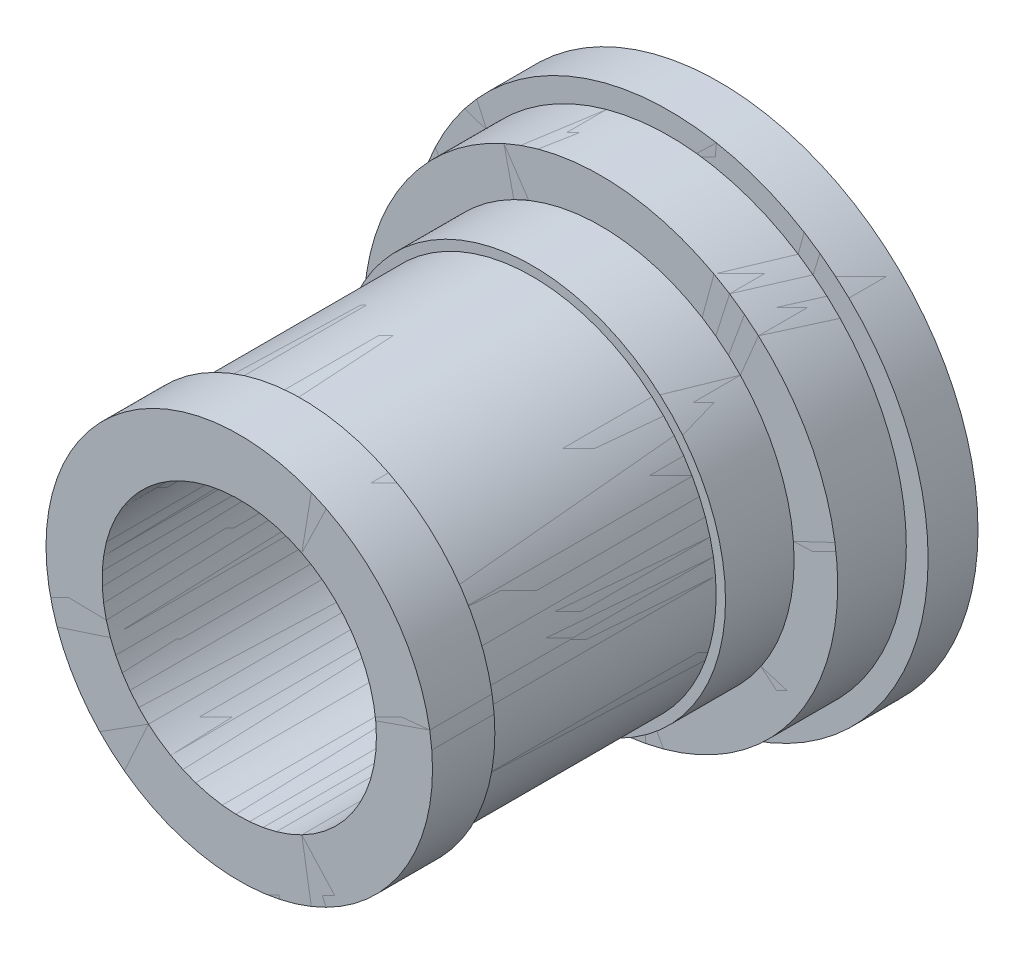
ISO-10303-21;
HEADER;
FILE_DESCRIPTION(('STEP AP214'),'2;1');
FILE_NAME('part.step','',(''),(''),'','','');
FILE_SCHEMA(('AUTOMOTIVE_DESIGN { 1 0 10303 214 1 1 1 1 }'));
ENDSEC;
DATA;
#1=APPLICATION_CONTEXT('core data for automotive mechanical design processes');
#2=APPLICATION_PROTOCOL_DEFINITION('international standard','automotive_design',2000,#1);
#3=PRODUCT_CONTEXT('',#1,'mechanical');
#4=PRODUCT('Part','Part','',(#3));
#5=PRODUCT_RELATED_PRODUCT_CATEGORY('part','',(#4));
#6=PRODUCT_DEFINITION_FORMATION('','',#4);
#7=PRODUCT_DEFINITION_CONTEXT('part definition',#1,'design');
#8=PRODUCT_DEFINITION('design','',#6,#7);
#9=PRODUCT_DEFINITION_SHAPE('','',#8);
#10=(LENGTH_UNIT() NAMED_UNIT(*) SI_UNIT(.MILLI.,.METRE.));
#11=(NAMED_UNIT(*) PLANE_ANGLE_UNIT() SI_UNIT($,.RADIAN.));
#12=(NAMED_UNIT(*) SI_UNIT($,.STERADIAN.) SOLID_ANGLE_UNIT());
#13=UNCERTAINTY_MEASURE_WITH_UNIT(LENGTH_MEASURE(1.E-05),#10,'distance_accuracy_value','');
#14=(GEOMETRIC_REPRESENTATION_CONTEXT(3) GLOBAL_UNCERTAINTY_ASSIGNED_CONTEXT((#13)) GLOBAL_UNIT_ASSIGNED_CONTEXT((#10,
#11,#12)) REPRESENTATION_CONTEXT('',''));
#15=CARTESIAN_POINT('',(0.,0.,0.));
#16=DIRECTION('',(0.,0.,1.));
#17=DIRECTION('',(1.,0.,0.));
#18=AXIS2_PLACEMENT_3D('',#15,#16,#17);
#19=CARTESIAN_POINT('',(-22.,0.,-77.));
#20=DIRECTION('',(0.,0.,1.));
#21=DIRECTION('',(1.,0.,0.));
#22=AXIS2_PLACEMENT_3D('',#19,#20,#21);
#23=PLANE('',#22);
#24=CARTESIAN_POINT('',(0.,0.,-77.));
#25=DIRECTION('',(0.,0.,1.));
#26=DIRECTION('',(1.,0.,0.));
#27=AXIS2_PLACEMENT_3D('',#24,#25,#26);
#28=CIRCLE('',#27,41.5);
#29=CARTESIAN_POINT('',(41.5,0.,-77.));
#30=VERTEX_POINT('',#29);
#31=EDGE_CURVE('E78',#30,#30,#28,.T.);
#32=ORIENTED_EDGE('',*,*,#31,.F.);
#33=EDGE_LOOP('',(#32));
#34=FACE_BOUND('',#33,.T.);
#35=CARTESIAN_POINT('',(0.,0.,-77.));
#36=DIRECTION('',(0.,0.,1.));
#37=DIRECTION('',(1.,0.,0.));
#38=AXIS2_PLACEMENT_3D('',#35,#36,#37);
#39=CIRCLE('',#38,22.);
#40=CARTESIAN_POINT('',(22.,0.,-77.));
#41=VERTEX_POINT('',#40);
#42=EDGE_CURVE('E11',#41,#41,#39,.T.);
#43=ORIENTED_EDGE('',*,*,#42,.T.);
#44=EDGE_LOOP('',(#43));
#45=FACE_BOUND('',#44,.T.);
#46=ADVANCED_FACE('F38',(#34,#45),#23,.F.);
#47=CARTESIAN_POINT('',(0.,0.,0.));
#48=DIRECTION('',(0.,0.,1.));
#49=DIRECTION('',(1.,0.,0.));
#50=AXIS2_PLACEMENT_3D('',#47,#48,#49);
#51=CYLINDRICAL_SURFACE('',#50,22.);
#52=ORIENTED_EDGE('',*,*,#42,.F.);
#53=EDGE_LOOP('',(#52));
#54=FACE_BOUND('',#53,.T.);
#55=CARTESIAN_POINT('',(0.,0.,0.));
#56=DIRECTION('',(0.,0.,1.));
#57=DIRECTION('',(1.,0.,0.));
#58=AXIS2_PLACEMENT_3D('',#55,#56,#57);
#59=CIRCLE('',#58,22.);
#60=CARTESIAN_POINT('',(22.,0.,0.));
#61=VERTEX_POINT('',#60);
#62=EDGE_CURVE('E44',#61,#61,#59,.T.);
#63=ORIENTED_EDGE('',*,*,#62,.T.);
#64=EDGE_LOOP('',(#63));
#65=FACE_BOUND('',#64,.T.);
#66=ADVANCED_FACE('F85',(#54,#65),#51,.F.);
#67=CARTESIAN_POINT('',(-22.,0.,0.));
#68=DIRECTION('',(0.,0.,-1.));
#69=DIRECTION('',(-1.,0.,0.));
#70=AXIS2_PLACEMENT_3D('',#67,#68,#69);
#71=PLANE('',#70);
#72=ORIENTED_EDGE('',*,*,#62,.F.);
#73=EDGE_LOOP('',(#72));
#74=FACE_BOUND('',#73,.T.);
#75=CARTESIAN_POINT('',(0.,0.,0.));
#76=DIRECTION('',(0.,0.,1.));
#77=DIRECTION('',(1.,0.,0.));
#78=AXIS2_PLACEMENT_3D('',#75,#76,#77);
#79=CIRCLE('',#78,31.);
#80=CARTESIAN_POINT('',(31.,0.,0.));
#81=VERTEX_POINT('',#80);
#82=EDGE_CURVE('E48',#81,#81,#79,.T.);
#83=ORIENTED_EDGE('',*,*,#82,.T.);
#84=EDGE_LOOP('',(#83));
#85=FACE_BOUND('',#84,.T.);
#86=ADVANCED_FACE('F89',(#74,#85),#71,.F.);
#87=CARTESIAN_POINT('',(0.,0.,0.));
#88=DIRECTION('',(0.,0.,1.));
#89=DIRECTION('',(1.,0.,0.));
#90=AXIS2_PLACEMENT_3D('',#87,#88,#89);
#91=CYLINDRICAL_SURFACE('',#90,31.);
#92=ORIENTED_EDGE('',*,*,#82,.F.);
#93=EDGE_LOOP('',(#92));
#94=FACE_BOUND('',#93,.T.);
#95=CARTESIAN_POINT('',(0.,0.,-10.));
#96=DIRECTION('',(0.,0.,1.));
#97=DIRECTION('',(1.,0.,0.));
#98=AXIS2_PLACEMENT_3D('',#95,#96,#97);
#99=CIRCLE('',#98,31.);
#100=CARTESIAN_POINT('',(31.,0.,-10.));
#101=VERTEX_POINT('',#100);
#102=EDGE_CURVE('E52',#101,#101,#99,.T.);
#103=ORIENTED_EDGE('',*,*,#102,.T.);
#104=EDGE_LOOP('',(#103));
#105=FACE_BOUND('',#104,.T.);
#106=ADVANCED_FACE('F94',(#94,#105),#91,.T.);
#107=CARTESIAN_POINT('',(-29.5,0.,-10.));
#108=DIRECTION('',(0.,0.,1.));
#109=DIRECTION('',(1.,0.,0.));
#110=AXIS2_PLACEMENT_3D('',#107,#108,#109);
#111=PLANE('',#110);
#112=ORIENTED_EDGE('',*,*,#102,.F.);
#113=EDGE_LOOP('',(#112));
#114=FACE_BOUND('',#113,.T.);
#115=CARTESIAN_POINT('',(0.,0.,-10.));
#116=DIRECTION('',(0.,0.,1.));
#117=DIRECTION('',(1.,0.,0.));
#118=AXIS2_PLACEMENT_3D('',#115,#116,#117);
#119=CIRCLE('',#118,29.5);
#120=CARTESIAN_POINT('',(29.5,0.,-10.));
#121=VERTEX_POINT('',#120);
#122=EDGE_CURVE('E57',#121,#121,#119,.T.);
#123=ORIENTED_EDGE('',*,*,#122,.T.);
#124=EDGE_LOOP('',(#123));
#125=FACE_BOUND('',#124,.T.);
#126=ADVANCED_FACE('F100',(#114,#125),#111,.F.);
#127=CARTESIAN_POINT('',(0.,0.,0.));
#128=DIRECTION('',(0.,0.,1.));
#129=DIRECTION('',(1.,0.,0.));
#130=AXIS2_PLACEMENT_3D('',#127,#128,#129);
#131=CYLINDRICAL_SURFACE('',#130,29.5);
#132=ORIENTED_EDGE('',*,*,#122,.F.);
#133=EDGE_LOOP('',(#132));
#134=FACE_BOUND('',#133,.T.);
#135=CARTESIAN_POINT('',(0.,0.,-47.));
#136=DIRECTION('',(0.,0.,1.));
#137=DIRECTION('',(1.,0.,0.));
#138=AXIS2_PLACEMENT_3D('',#135,#136,#137);
#139=CIRCLE('',#138,29.5);
#140=CARTESIAN_POINT('',(29.5,0.,-47.));
#141=VERTEX_POINT('',#140);
#142=EDGE_CURVE('E60',#141,#141,#139,.T.);
#143=ORIENTED_EDGE('',*,*,#142,.T.);
#144=EDGE_LOOP('',(#143));
#145=FACE_BOUND('',#144,.T.);
#146=ADVANCED_FACE('F104',(#134,#145),#131,.T.);
#147=CARTESIAN_POINT('',(-29.5,0.,-47.));
#148=DIRECTION('',(0.,0.,-1.));
#149=DIRECTION('',(-1.,0.,0.));
#150=AXIS2_PLACEMENT_3D('',#147,#148,#149);
#151=PLANE('',#150);
#152=ORIENTED_EDGE('',*,*,#142,.F.);
#153=EDGE_LOOP('',(#152));
#154=FACE_BOUND('',#153,.T.);
#155=CARTESIAN_POINT('',(0.,0.,-47.));
#156=DIRECTION('',(0.,0.,1.));
#157=DIRECTION('',(1.,0.,0.));
#158=AXIS2_PLACEMENT_3D('',#155,#156,#157);
#159=CIRCLE('',#158,31.);
#160=CARTESIAN_POINT('',(31.,0.,-47.));
#161=VERTEX_POINT('',#160);
#162=EDGE_CURVE('E63',#161,#161,#159,.T.);
#163=ORIENTED_EDGE('',*,*,#162,.T.);
#164=EDGE_LOOP('',(#163));
#165=FACE_BOUND('',#164,.T.);
#166=ADVANCED_FACE('F108',(#154,#165),#151,.F.);
#167=CARTESIAN_POINT('',(0.,0.,0.));
#168=DIRECTION('',(0.,0.,1.));
#169=DIRECTION('',(1.,0.,0.));
#170=AXIS2_PLACEMENT_3D('',#167,#168,#169);
#171=CYLINDRICAL_SURFACE('',#170,31.);
#172=ORIENTED_EDGE('',*,*,#162,.F.);
#173=EDGE_LOOP('',(#172));
#174=FACE_BOUND('',#173,.T.);
#175=CARTESIAN_POINT('',(0.,0.,-58.));
#176=DIRECTION('',(0.,0.,1.));
#177=DIRECTION('',(1.,0.,0.));
#178=AXIS2_PLACEMENT_3D('',#175,#176,#177);
#179=CIRCLE('',#178,31.);
#180=CARTESIAN_POINT('',(31.,0.,-58.));
#181=VERTEX_POINT('',#180);
#182=EDGE_CURVE('E66',#181,#181,#179,.T.);
#183=ORIENTED_EDGE('',*,*,#182,.T.);
#184=EDGE_LOOP('',(#183));
#185=FACE_BOUND('',#184,.T.);
#186=ADVANCED_FACE('F112',(#174,#185),#171,.T.);
#187=CARTESIAN_POINT('',(-31.,0.,-58.));
#188=DIRECTION('',(0.,0.,-1.));
#189=DIRECTION('',(-1.,0.,0.));
#190=AXIS2_PLACEMENT_3D('',#187,#188,#189);
#191=PLANE('',#190);
#192=ORIENTED_EDGE('',*,*,#182,.F.);
#193=EDGE_LOOP('',(#192));
#194=FACE_BOUND('',#193,.T.);
#195=CARTESIAN_POINT('',(0.,0.,-58.));
#196=DIRECTION('',(0.,0.,1.));
#197=DIRECTION('',(1.,0.,0.));
#198=AXIS2_PLACEMENT_3D('',#195,#196,#197);
#199=CIRCLE('',#198,38.);
#200=CARTESIAN_POINT('',(38.,0.,-58.));
#201=VERTEX_POINT('',#200);
#202=EDGE_CURVE('E69',#201,#201,#199,.T.);
#203=ORIENTED_EDGE('',*,*,#202,.T.);
#204=EDGE_LOOP('',(#203));
#205=FACE_BOUND('',#204,.T.);
#206=ADVANCED_FACE('F116',(#194,#205),#191,.F.);
#207=CARTESIAN_POINT('',(0.,0.,0.));
#208=DIRECTION('',(0.,0.,1.));
#209=DIRECTION('',(1.,0.,0.));
#210=AXIS2_PLACEMENT_3D('',#207,#208,#209);
#211=CYLINDRICAL_SURFACE('',#210,38.);
#212=ORIENTED_EDGE('',*,*,#202,.F.);
#213=EDGE_LOOP('',(#212));
#214=FACE_BOUND('',#213,.T.);
#215=CARTESIAN_POINT('',(0.,0.,-69.));
#216=DIRECTION('',(0.,0.,1.));
#217=DIRECTION('',(1.,0.,0.));
#218=AXIS2_PLACEMENT_3D('',#215,#216,#217);
#219=CIRCLE('',#218,38.);
#220=CARTESIAN_POINT('',(38.,0.,-69.));
#221=VERTEX_POINT('',#220);
#222=EDGE_CURVE('E72',#221,#221,#219,.T.);
#223=ORIENTED_EDGE('',*,*,#222,.T.);
#224=EDGE_LOOP('',(#223));
#225=FACE_BOUND('',#224,.T.);
#226=ADVANCED_FACE('F120',(#214,#225),#211,.T.);
#227=CARTESIAN_POINT('',(-38.,0.,-69.));
#228=DIRECTION('',(0.,0.,-1.));
#229=DIRECTION('',(-1.,0.,0.));
#230=AXIS2_PLACEMENT_3D('',#227,#228,#229);
#231=PLANE('',#230);
#232=ORIENTED_EDGE('',*,*,#222,.F.);
#233=EDGE_LOOP('',(#232));
#234=FACE_BOUND('',#233,.T.);
#235=CARTESIAN_POINT('',(0.,0.,-69.));
#236=DIRECTION('',(0.,0.,1.));
#237=DIRECTION('',(1.,0.,0.));
#238=AXIS2_PLACEMENT_3D('',#235,#236,#237);
#239=CIRCLE('',#238,41.5);
#240=CARTESIAN_POINT('',(41.5,0.,-69.));
#241=VERTEX_POINT('',#240);
#242=EDGE_CURVE('E75',#241,#241,#239,.T.);
#243=ORIENTED_EDGE('',*,*,#242,.T.);
#244=EDGE_LOOP('',(#243));
#245=FACE_BOUND('',#244,.T.);
#246=ADVANCED_FACE('F124',(#234,#245),#231,.F.);
#247=CARTESIAN_POINT('',(0.,0.,0.));
#248=DIRECTION('',(0.,0.,1.));
#249=DIRECTION('',(1.,0.,0.));
#250=AXIS2_PLACEMENT_3D('',#247,#248,#249);
#251=CYLINDRICAL_SURFACE('',#250,41.5);
#252=ORIENTED_EDGE('',*,*,#242,.F.);
#253=EDGE_LOOP('',(#252));
#254=FACE_BOUND('',#253,.T.);
#255=ORIENTED_EDGE('',*,*,#31,.T.);
#256=EDGE_LOOP('',(#255));
#257=FACE_BOUND('',#256,.T.);
#258=ADVANCED_FACE('F82',(#254,#257),#251,.T.);
#259=CLOSED_SHELL('',(#46,#66,#86,#106,#126,#146,#166,#186,#206,#226,#246,#258));
#260=MANIFOLD_SOLID_BREP('B2',#259);
#261=CARTESIAN_POINT('',(22.,0.,0.));
#262=DIRECTION('',(0.,0.,1.));
#263=DIRECTION('',(1.,0.,0.));
#264=AXIS2_PLACEMENT_3D('',#261,#262,#263);
#265=PLANE('',#264);
#266=CARTESIAN_POINT('',(0.,0.,0.));
#267=DIRECTION('',(0.,0.,1.));
#268=DIRECTION('',(1.,0.,0.));
#269=AXIS2_PLACEMENT_3D('',#266,#267,#268);
#270=CIRCLE('',#269,31.);
#271=CARTESIAN_POINT('',(31.,0.,0.));
#272=VERTEX_POINT('',#271);
#273=EDGE_CURVE('E37',#272,#272,#270,.T.);
#274=ORIENTED_EDGE('',*,*,#273,.T.);
#275=EDGE_LOOP('',(#274));
#276=FACE_BOUND('',#275,.T.);
#277=CARTESIAN_POINT('',(0.,0.,0.));
#278=DIRECTION('',(0.,0.,1.));
#279=DIRECTION('',(1.,0.,0.));
#280=AXIS2_PLACEMENT_3D('',#277,#278,#279);
#281=CIRCLE('',#280,22.);
#282=CARTESIAN_POINT('',(22.,0.,0.));
#283=VERTEX_POINT('',#282);
#284=EDGE_CURVE('E259',#283,#283,#281,.T.);
#285=ORIENTED_EDGE('',*,*,#284,.F.);
#286=EDGE_LOOP('',(#285));
#287=FACE_BOUND('',#286,.T.);
#288=ADVANCED_FACE('F219',(#276,#287),#265,.T.);
#289=CARTESIAN_POINT('',(0.,0.,0.));
#290=DIRECTION('',(0.,0.,1.));
#291=DIRECTION('',(1.,0.,0.));
#292=AXIS2_PLACEMENT_3D('',#289,#290,#291);
#293=CYLINDRICAL_SURFACE('',#292,31.);
#294=CARTESIAN_POINT('',(0.,0.,-10.));
#295=DIRECTION('',(0.,0.,1.));
#296=DIRECTION('',(1.,0.,0.));
#297=AXIS2_PLACEMENT_3D('',#294,#295,#296);
#298=CIRCLE('',#297,31.);
#299=CARTESIAN_POINT('',(31.,0.,-10.));
#300=VERTEX_POINT('',#299);
#301=EDGE_CURVE('E225',#300,#300,#298,.T.);
#302=ORIENTED_EDGE('',*,*,#301,.T.);
#303=EDGE_LOOP('',(#302));
#304=FACE_BOUND('',#303,.T.);
#305=ORIENTED_EDGE('',*,*,#273,.F.);
#306=EDGE_LOOP('',(#305));
#307=FACE_BOUND('',#306,.T.);
#308=ADVANCED_FACE('F267',(#304,#307),#293,.T.);
#309=CARTESIAN_POINT('',(29.5,0.,-10.));
#310=DIRECTION('',(0.,0.,-1.));
#311=DIRECTION('',(-1.,0.,0.));
#312=AXIS2_PLACEMENT_3D('',#309,#310,#311);
#313=PLANE('',#312);
#314=CARTESIAN_POINT('',(0.,0.,-10.));
#315=DIRECTION('',(0.,0.,1.));
#316=DIRECTION('',(1.,0.,0.));
#317=AXIS2_PLACEMENT_3D('',#314,#315,#316);
#318=CIRCLE('',#317,29.5);
#319=CARTESIAN_POINT('',(29.5,0.,-10.));
#320=VERTEX_POINT('',#319);
#321=EDGE_CURVE('E229',#320,#320,#318,.T.);
#322=ORIENTED_EDGE('',*,*,#321,.T.);
#323=EDGE_LOOP('',(#322));
#324=FACE_BOUND('',#323,.T.);
#325=ORIENTED_EDGE('',*,*,#301,.F.);
#326=EDGE_LOOP('',(#325));
#327=FACE_BOUND('',#326,.T.);
#328=ADVANCED_FACE('F271',(#324,#327),#313,.T.);
#329=CARTESIAN_POINT('',(0.,0.,0.));
#330=DIRECTION('',(0.,0.,1.));
#331=DIRECTION('',(1.,0.,0.));
#332=AXIS2_PLACEMENT_3D('',#329,#330,#331);
#333=CYLINDRICAL_SURFACE('',#332,29.5);
#334=CARTESIAN_POINT('',(0.,0.,-47.));
#335=DIRECTION('',(0.,0.,1.));
#336=DIRECTION('',(1.,0.,0.));
#337=AXIS2_PLACEMENT_3D('',#334,#335,#336);
#338=CIRCLE('',#337,29.5);
#339=CARTESIAN_POINT('',(29.5,0.,-47.));
#340=VERTEX_POINT('',#339);
#341=EDGE_CURVE('E233',#340,#340,#338,.T.);
#342=ORIENTED_EDGE('',*,*,#341,.T.);
#343=EDGE_LOOP('',(#342));
#344=FACE_BOUND('',#343,.T.);
#345=ORIENTED_EDGE('',*,*,#321,.F.);
#346=EDGE_LOOP('',(#345));
#347=FACE_BOUND('',#346,.T.);
#348=ADVANCED_FACE('F275',(#344,#347),#333,.T.);
#349=CARTESIAN_POINT('',(29.5,0.,-47.));
#350=DIRECTION('',(0.,0.,1.));
#351=DIRECTION('',(1.,0.,0.));
#352=AXIS2_PLACEMENT_3D('',#349,#350,#351);
#353=PLANE('',#352);
#354=CARTESIAN_POINT('',(0.,0.,-47.));
#355=DIRECTION('',(0.,0.,1.));
#356=DIRECTION('',(1.,0.,0.));
#357=AXIS2_PLACEMENT_3D('',#354,#355,#356);
#358=CIRCLE('',#357,31.);
#359=CARTESIAN_POINT('',(31.,0.,-47.));
#360=VERTEX_POINT('',#359);
#361=EDGE_CURVE('E238',#360,#360,#358,.T.);
#362=ORIENTED_EDGE('',*,*,#361,.T.);
#363=EDGE_LOOP('',(#362));
#364=FACE_BOUND('',#363,.T.);
#365=ORIENTED_EDGE('',*,*,#341,.F.);
#366=EDGE_LOOP('',(#365));
#367=FACE_BOUND('',#366,.T.);
#368=ADVANCED_FACE('F282',(#364,#367),#353,.T.);
#369=CARTESIAN_POINT('',(0.,0.,0.));
#370=DIRECTION('',(0.,0.,1.));
#371=DIRECTION('',(1.,0.,0.));
#372=AXIS2_PLACEMENT_3D('',#369,#370,#371);
#373=CYLINDRICAL_SURFACE('',#372,31.);
#374=CARTESIAN_POINT('',(0.,0.,-58.));
#375=DIRECTION('',(0.,0.,1.));
#376=DIRECTION('',(1.,0.,0.));
#377=AXIS2_PLACEMENT_3D('',#374,#375,#376);
#378=CIRCLE('',#377,31.);
#379=CARTESIAN_POINT('',(31.,0.,-58.));
#380=VERTEX_POINT('',#379);
#381=EDGE_CURVE('E241',#380,#380,#378,.T.);
#382=ORIENTED_EDGE('',*,*,#381,.T.);
#383=EDGE_LOOP('',(#382));
#384=FACE_BOUND('',#383,.T.);
#385=ORIENTED_EDGE('',*,*,#361,.F.);
#386=EDGE_LOOP('',(#385));
#387=FACE_BOUND('',#386,.T.);
#388=ADVANCED_FACE('F286',(#384,#387),#373,.T.);
#389=CARTESIAN_POINT('',(31.,0.,-58.));
#390=DIRECTION('',(0.,0.,1.));
#391=DIRECTION('',(1.,0.,0.));
#392=AXIS2_PLACEMENT_3D('',#389,#390,#391);
#393=PLANE('',#392);
#394=CARTESIAN_POINT('',(0.,0.,-58.));
#395=DIRECTION('',(0.,0.,1.));
#396=DIRECTION('',(1.,0.,0.));
#397=AXIS2_PLACEMENT_3D('',#394,#395,#396);
#398=CIRCLE('',#397,38.);
#399=CARTESIAN_POINT('',(38.,0.,-58.));
#400=VERTEX_POINT('',#399);
#401=EDGE_CURVE('E244',#400,#400,#398,.T.);
#402=ORIENTED_EDGE('',*,*,#401,.T.);
#403=EDGE_LOOP('',(#402));
#404=FACE_BOUND('',#403,.T.);
#405=ORIENTED_EDGE('',*,*,#381,.F.);
#406=EDGE_LOOP('',(#405));
#407=FACE_BOUND('',#406,.T.);
#408=ADVANCED_FACE('F290',(#404,#407),#393,.T.);
#409=CARTESIAN_POINT('',(0.,0.,0.));
#410=DIRECTION('',(0.,0.,1.));
#411=DIRECTION('',(1.,0.,0.));
#412=AXIS2_PLACEMENT_3D('',#409,#410,#411);
#413=CYLINDRICAL_SURFACE('',#412,38.);
#414=CARTESIAN_POINT('',(0.,0.,-69.));
#415=DIRECTION('',(0.,0.,1.));
#416=DIRECTION('',(1.,0.,0.));
#417=AXIS2_PLACEMENT_3D('',#414,#415,#416);
#418=CIRCLE('',#417,38.);
#419=CARTESIAN_POINT('',(38.,0.,-69.));
#420=VERTEX_POINT('',#419);
#421=EDGE_CURVE('E247',#420,#420,#418,.T.);
#422=ORIENTED_EDGE('',*,*,#421,.T.);
#423=EDGE_LOOP('',(#422));
#424=FACE_BOUND('',#423,.T.);
#425=ORIENTED_EDGE('',*,*,#401,.F.);
#426=EDGE_LOOP('',(#425));
#427=FACE_BOUND('',#426,.T.);
#428=ADVANCED_FACE('F294',(#424,#427),#413,.T.);
#429=CARTESIAN_POINT('',(38.,0.,-69.));
#430=DIRECTION('',(0.,0.,1.));
#431=DIRECTION('',(1.,0.,0.));
#432=AXIS2_PLACEMENT_3D('',#429,#430,#431);
#433=PLANE('',#432);
#434=CARTESIAN_POINT('',(0.,0.,-69.));
#435=DIRECTION('',(0.,0.,1.));
#436=DIRECTION('',(1.,0.,0.));
#437=AXIS2_PLACEMENT_3D('',#434,#435,#436);
#438=CIRCLE('',#437,41.5);
#439=CARTESIAN_POINT('',(41.5,0.,-69.));
#440=VERTEX_POINT('',#439);
#441=EDGE_CURVE('E250',#440,#440,#438,.T.);
#442=ORIENTED_EDGE('',*,*,#441,.T.);
#443=EDGE_LOOP('',(#442));
#444=FACE_BOUND('',#443,.T.);
#445=ORIENTED_EDGE('',*,*,#421,.F.);
#446=EDGE_LOOP('',(#445));
#447=FACE_BOUND('',#446,.T.);
#448=ADVANCED_FACE('F298',(#444,#447),#433,.T.);
#449=CARTESIAN_POINT('',(0.,0.,0.));
#450=DIRECTION('',(0.,0.,1.));
#451=DIRECTION('',(1.,0.,0.));
#452=AXIS2_PLACEMENT_3D('',#449,#450,#451);
#453=CYLINDRICAL_SURFACE('',#452,41.5);
#454=CARTESIAN_POINT('',(0.,0.,-77.));
#455=DIRECTION('',(0.,0.,1.));
#456=DIRECTION('',(1.,0.,0.));
#457=AXIS2_PLACEMENT_3D('',#454,#455,#456);
#458=CIRCLE('',#457,41.5);
#459=CARTESIAN_POINT('',(41.5,0.,-77.));
#460=VERTEX_POINT('',#459);
#461=EDGE_CURVE('E253',#460,#460,#458,.T.);
#462=ORIENTED_EDGE('',*,*,#461,.T.);
#463=EDGE_LOOP('',(#462));
#464=FACE_BOUND('',#463,.T.);
#465=ORIENTED_EDGE('',*,*,#441,.F.);
#466=EDGE_LOOP('',(#465));
#467=FACE_BOUND('',#466,.T.);
#468=ADVANCED_FACE('F302',(#464,#467),#453,.T.);
#469=CARTESIAN_POINT('',(22.,0.,-77.));
#470=DIRECTION('',(0.,0.,-1.));
#471=DIRECTION('',(-1.,0.,0.));
#472=AXIS2_PLACEMENT_3D('',#469,#470,#471);
#473=PLANE('',#472);
#474=CARTESIAN_POINT('',(0.,0.,-77.));
#475=DIRECTION('',(0.,0.,1.));
#476=DIRECTION('',(1.,0.,0.));
#477=AXIS2_PLACEMENT_3D('',#474,#475,#476);
#478=CIRCLE('',#477,22.);
#479=CARTESIAN_POINT('',(22.,0.,-77.));
#480=VERTEX_POINT('',#479);
#481=EDGE_CURVE('E256',#480,#480,#478,.T.);
#482=ORIENTED_EDGE('',*,*,#481,.T.);
#483=EDGE_LOOP('',(#482));
#484=FACE_BOUND('',#483,.T.);
#485=ORIENTED_EDGE('',*,*,#461,.F.);
#486=EDGE_LOOP('',(#485));
#487=FACE_BOUND('',#486,.T.);
#488=ADVANCED_FACE('F306',(#484,#487),#473,.T.);
#489=CARTESIAN_POINT('',(0.,0.,0.));
#490=DIRECTION('',(0.,0.,1.));
#491=DIRECTION('',(1.,0.,0.));
#492=AXIS2_PLACEMENT_3D('',#489,#490,#491);
#493=CYLINDRICAL_SURFACE('',#492,22.);
#494=ORIENTED_EDGE('',*,*,#284,.T.);
#495=EDGE_LOOP('',(#494));
#496=FACE_BOUND('',#495,.T.);
#497=ORIENTED_EDGE('',*,*,#481,.F.);
#498=EDGE_LOOP('',(#497));
#499=FACE_BOUND('',#498,.T.);
#500=ADVANCED_FACE('F263',(#496,#499),#493,.F.);
#501=CLOSED_SHELL('',(#288,#308,#328,#348,#368,#388,#408,#428,#448,#468,#488,#500));
#502=MANIFOLD_SOLID_BREP('B6',#501);
#503=ADVANCED_BREP_SHAPE_REPRESENTATION('',(#18,#260,#502),#14);
#504=SHAPE_DEFINITION_REPRESENTATION(#9,#503);
ENDSEC;
END-ISO-10303-21;
